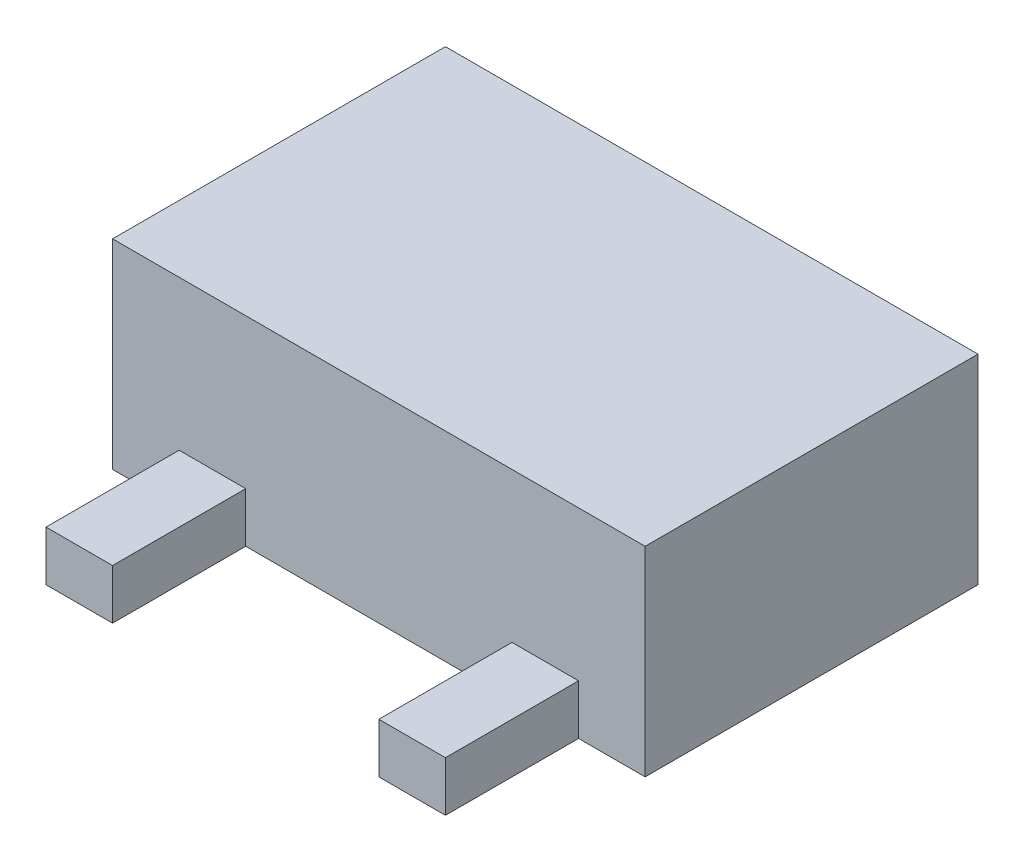
ISO-10303-21;
HEADER;
FILE_DESCRIPTION(('STEP AP214'),'2;1');
FILE_NAME('part.step','',(''),(''),'','','');
FILE_SCHEMA(('AUTOMOTIVE_DESIGN { 1 0 10303 214 1 1 1 1 }'));
ENDSEC;
DATA;
#1=APPLICATION_CONTEXT('core data for automotive mechanical design processes');
#2=APPLICATION_PROTOCOL_DEFINITION('international standard','automotive_design',2000,#1);
#3=PRODUCT_CONTEXT('',#1,'mechanical');
#4=PRODUCT('Part','Part','',(#3));
#5=PRODUCT_RELATED_PRODUCT_CATEGORY('part','',(#4));
#6=PRODUCT_DEFINITION_FORMATION('','',#4);
#7=PRODUCT_DEFINITION_CONTEXT('part definition',#1,'design');
#8=PRODUCT_DEFINITION('design','',#6,#7);
#9=PRODUCT_DEFINITION_SHAPE('','',#8);
#10=(LENGTH_UNIT() NAMED_UNIT(*) SI_UNIT(.MILLI.,.METRE.));
#11=(NAMED_UNIT(*) PLANE_ANGLE_UNIT() SI_UNIT($,.RADIAN.));
#12=(NAMED_UNIT(*) SI_UNIT($,.STERADIAN.) SOLID_ANGLE_UNIT());
#13=UNCERTAINTY_MEASURE_WITH_UNIT(LENGTH_MEASURE(1.E-05),#10,'distance_accuracy_value','');
#14=(GEOMETRIC_REPRESENTATION_CONTEXT(3) GLOBAL_UNCERTAINTY_ASSIGNED_CONTEXT((#13)) GLOBAL_UNIT_ASSIGNED_CONTEXT((#10,
#11,#12)) REPRESENTATION_CONTEXT('',''));
#15=CARTESIAN_POINT('',(0.,0.,0.));
#16=DIRECTION('',(0.,0.,1.));
#17=DIRECTION('',(1.,0.,0.));
#18=AXIS2_PLACEMENT_3D('',#15,#16,#17);
#19=CARTESIAN_POINT('',(-0.8,0.6,0.5));
#20=DIRECTION('',(0.,0.,-1.));
#21=DIRECTION('',(-1.,0.,0.));
#22=AXIS2_PLACEMENT_3D('',#19,#20,#21);
#23=PLANE('',#22);
#24=DIRECTION('',(-1.,0.,0.));
#25=VECTOR('',#24,1.);
#26=CARTESIAN_POINT('',(0.6,0.15,0.5));
#27=LINE('',#26,#25);
#28=CARTESIAN_POINT('',(0.6,0.15,0.5));
#29=VERTEX_POINT('',#28);
#30=CARTESIAN_POINT('',(0.4,0.15,0.5));
#31=VERTEX_POINT('',#30);
#32=EDGE_CURVE('E53',#29,#31,#27,.T.);
#33=ORIENTED_EDGE('',*,*,#32,.F.);
#34=DIRECTION('',(0.,-1.,0.));
#35=VECTOR('',#34,1.);
#36=CARTESIAN_POINT('',(0.6,0.597213595499958,0.5));
#37=LINE('',#36,#35);
#38=CARTESIAN_POINT('',(0.6,0.,0.5));
#39=VERTEX_POINT('',#38);
#40=EDGE_CURVE('E161',#29,#39,#37,.T.);
#41=ORIENTED_EDGE('',*,*,#40,.T.);
#42=DIRECTION('',(1.,0.,0.));
#43=VECTOR('',#42,1.);
#44=CARTESIAN_POINT('',(-0.8,0.,0.5));
#45=LINE('',#44,#43);
#46=CARTESIAN_POINT('',(0.8,0.,0.5));
#47=VERTEX_POINT('',#46);
#48=EDGE_CURVE('E146',#39,#47,#45,.T.);
#49=ORIENTED_EDGE('',*,*,#48,.T.);
#50=DIRECTION('',(0.,-1.,0.));
#51=VECTOR('',#50,1.);
#52=CARTESIAN_POINT('',(0.8,0.6,0.5));
#53=LINE('',#52,#51);
#54=CARTESIAN_POINT('',(0.8,0.6,0.5));
#55=VERTEX_POINT('',#54);
#56=EDGE_CURVE('E248',#55,#47,#53,.T.);
#57=ORIENTED_EDGE('',*,*,#56,.F.);
#58=DIRECTION('',(1.,0.,0.));
#59=VECTOR('',#58,1.);
#60=CARTESIAN_POINT('',(-0.8,0.6,0.5));
#61=LINE('',#60,#59);
#62=CARTESIAN_POINT('',(-0.8,0.6,0.5));
#63=VERTEX_POINT('',#62);
#64=EDGE_CURVE('E246',#63,#55,#61,.T.);
#65=ORIENTED_EDGE('',*,*,#64,.F.);
#66=DIRECTION('',(0.,-1.,0.));
#67=VECTOR('',#66,1.);
#68=CARTESIAN_POINT('',(-0.8,0.6,0.5));
#69=LINE('',#68,#67);
#70=CARTESIAN_POINT('',(-0.8,0.,0.5));
#71=VERTEX_POINT('',#70);
#72=EDGE_CURVE('E257',#63,#71,#69,.T.);
#73=ORIENTED_EDGE('',*,*,#72,.T.);
#74=CARTESIAN_POINT('',(-0.6,0.,0.5));
#75=VERTEX_POINT('',#74);
#76=EDGE_CURVE('E159',#71,#75,#45,.T.);
#77=ORIENTED_EDGE('',*,*,#76,.T.);
#78=DIRECTION('',(0.,-1.,0.));
#79=VECTOR('',#78,1.);
#80=CARTESIAN_POINT('',(-0.6,0.597213595499958,0.5));
#81=LINE('',#80,#79);
#82=CARTESIAN_POINT('',(-0.6,0.15,0.5));
#83=VERTEX_POINT('',#82);
#84=EDGE_CURVE('E204',#83,#75,#81,.T.);
#85=ORIENTED_EDGE('',*,*,#84,.F.);
#86=DIRECTION('',(1.,0.,0.));
#87=VECTOR('',#86,1.);
#88=CARTESIAN_POINT('',(-0.6,0.15,0.5));
#89=LINE('',#88,#87);
#90=CARTESIAN_POINT('',(-0.4,0.15,0.5));
#91=VERTEX_POINT('',#90);
#92=EDGE_CURVE('E190',#83,#91,#89,.T.);
#93=ORIENTED_EDGE('',*,*,#92,.T.);
#94=DIRECTION('',(0.,-1.,0.));
#95=VECTOR('',#94,1.);
#96=CARTESIAN_POINT('',(-0.4,0.597213595499958,0.5));
#97=LINE('',#96,#95);
#98=CARTESIAN_POINT('',(-0.4,0.,0.5));
#99=VERTEX_POINT('',#98);
#100=EDGE_CURVE('E206',#91,#99,#97,.T.);
#101=ORIENTED_EDGE('',*,*,#100,.T.);
#102=CARTESIAN_POINT('',(0.4,0.,0.5));
#103=VERTEX_POINT('',#102);
#104=EDGE_CURVE('E156',#99,#103,#45,.T.);
#105=ORIENTED_EDGE('',*,*,#104,.T.);
#106=DIRECTION('',(0.,-1.,0.));
#107=VECTOR('',#106,1.);
#108=CARTESIAN_POINT('',(0.4,0.597213595499958,0.5));
#109=LINE('',#108,#107);
#110=EDGE_CURVE('E49',#31,#103,#109,.T.);
#111=ORIENTED_EDGE('',*,*,#110,.F.);
#112=EDGE_LOOP('',(#33,#41,#49,#57,#65,#73,#77,#85,#93,#101,#105,#111));
#113=FACE_BOUND('',#112,.T.);
#114=ADVANCED_FACE('F34',(#113),#23,.F.);
#115=CARTESIAN_POINT('',(-0.8,0.6,-0.5));
#116=DIRECTION('',(0.,0.,1.));
#117=DIRECTION('',(1.,0.,0.));
#118=AXIS2_PLACEMENT_3D('',#115,#116,#117);
#119=PLANE('',#118);
#120=DIRECTION('',(0.,-1.,0.));
#121=VECTOR('',#120,1.);
#122=CARTESIAN_POINT('',(0.1,0.15,-0.500000000000001));
#123=LINE('',#122,#121);
#124=CARTESIAN_POINT('',(0.1,0.15,-0.500000000000001));
#125=VERTEX_POINT('',#124);
#126=CARTESIAN_POINT('',(0.1,0.,-0.500000000000001));
#127=VERTEX_POINT('',#126);
#128=EDGE_CURVE('E234',#125,#127,#123,.T.);
#129=ORIENTED_EDGE('',*,*,#128,.F.);
#130=DIRECTION('',(1.,0.,0.));
#131=VECTOR('',#130,1.);
#132=CARTESIAN_POINT('',(-0.1,0.15,-0.500000000000001));
#133=LINE('',#132,#131);
#134=CARTESIAN_POINT('',(-0.1,0.15,-0.500000000000001));
#135=VERTEX_POINT('',#134);
#136=EDGE_CURVE('E217',#135,#125,#133,.T.);
#137=ORIENTED_EDGE('',*,*,#136,.F.);
#138=DIRECTION('',(0.,-1.,0.));
#139=VECTOR('',#138,1.);
#140=CARTESIAN_POINT('',(-0.1,0.15,-0.500000000000001));
#141=LINE('',#140,#139);
#142=CARTESIAN_POINT('',(-0.1,0.,-0.5));
#143=VERTEX_POINT('',#142);
#144=EDGE_CURVE('E236',#135,#143,#141,.T.);
#145=ORIENTED_EDGE('',*,*,#144,.T.);
#146=DIRECTION('',(-1.,0.,0.));
#147=VECTOR('',#146,1.);
#148=CARTESIAN_POINT('',(-0.8,0.,-0.5));
#149=LINE('',#148,#147);
#150=CARTESIAN_POINT('',(-0.8,0.,-0.5));
#151=VERTEX_POINT('',#150);
#152=EDGE_CURVE('E250',#143,#151,#149,.T.);
#153=ORIENTED_EDGE('',*,*,#152,.T.);
#154=DIRECTION('',(0.,-1.,0.));
#155=VECTOR('',#154,1.);
#156=CARTESIAN_POINT('',(-0.8,0.6,-0.5));
#157=LINE('',#156,#155);
#158=CARTESIAN_POINT('',(-0.8,0.6,-0.5));
#159=VERTEX_POINT('',#158);
#160=EDGE_CURVE('E42',#159,#151,#157,.T.);
#161=ORIENTED_EDGE('',*,*,#160,.F.);
#162=DIRECTION('',(-1.,0.,0.));
#163=VECTOR('',#162,1.);
#164=CARTESIAN_POINT('',(-0.8,0.6,-0.5));
#165=LINE('',#164,#163);
#166=CARTESIAN_POINT('',(0.8,0.6,-0.5));
#167=VERTEX_POINT('',#166);
#168=EDGE_CURVE('E242',#167,#159,#165,.T.);
#169=ORIENTED_EDGE('',*,*,#168,.F.);
#170=DIRECTION('',(0.,-1.,0.));
#171=VECTOR('',#170,1.);
#172=CARTESIAN_POINT('',(0.8,0.6,-0.5));
#173=LINE('',#172,#171);
#174=CARTESIAN_POINT('',(0.8,0.,-0.5));
#175=VERTEX_POINT('',#174);
#176=EDGE_CURVE('E11',#167,#175,#173,.T.);
#177=ORIENTED_EDGE('',*,*,#176,.T.);
#178=EDGE_CURVE('E251',#175,#127,#149,.T.);
#179=ORIENTED_EDGE('',*,*,#178,.T.);
#180=EDGE_LOOP('',(#129,#137,#145,#153,#161,#169,#177,#179));
#181=FACE_BOUND('',#180,.T.);
#182=ADVANCED_FACE('F279',(#181),#119,.F.);
#183=CARTESIAN_POINT('',(0.8,0.6,-0.5));
#184=DIRECTION('',(-1.,0.,0.));
#185=DIRECTION('',(0.,0.,1.));
#186=AXIS2_PLACEMENT_3D('',#183,#184,#185);
#187=PLANE('',#186);
#188=DIRECTION('',(0.,0.,-1.));
#189=VECTOR('',#188,1.);
#190=CARTESIAN_POINT('',(0.8,0.,-0.5));
#191=LINE('',#190,#189);
#192=EDGE_CURVE('E153',#47,#175,#191,.T.);
#193=ORIENTED_EDGE('',*,*,#192,.T.);
#194=ORIENTED_EDGE('',*,*,#176,.F.);
#195=DIRECTION('',(0.,0.,-1.));
#196=VECTOR('',#195,1.);
#197=CARTESIAN_POINT('',(0.8,0.6,-0.5));
#198=LINE('',#197,#196);
#199=EDGE_CURVE('E239',#55,#167,#198,.T.);
#200=ORIENTED_EDGE('',*,*,#199,.F.);
#201=ORIENTED_EDGE('',*,*,#56,.T.);
#202=EDGE_LOOP('',(#193,#194,#200,#201));
#203=FACE_BOUND('',#202,.T.);
#204=ADVANCED_FACE('F36',(#203),#187,.F.);
#205=CARTESIAN_POINT('',(-0.8,0.6,-0.5));
#206=DIRECTION('',(1.,0.,0.));
#207=DIRECTION('',(0.,0.,-1.));
#208=AXIS2_PLACEMENT_3D('',#205,#206,#207);
#209=PLANE('',#208);
#210=DIRECTION('',(0.,0.,1.));
#211=VECTOR('',#210,1.);
#212=CARTESIAN_POINT('',(-0.8,0.,-0.5));
#213=LINE('',#212,#211);
#214=EDGE_CURVE('E157',#151,#71,#213,.T.);
#215=ORIENTED_EDGE('',*,*,#214,.T.);
#216=ORIENTED_EDGE('',*,*,#72,.F.);
#217=DIRECTION('',(0.,0.,1.));
#218=VECTOR('',#217,1.);
#219=CARTESIAN_POINT('',(-0.8,0.6,-0.5));
#220=LINE('',#219,#218);
#221=EDGE_CURVE('E244',#159,#63,#220,.T.);
#222=ORIENTED_EDGE('',*,*,#221,.F.);
#223=ORIENTED_EDGE('',*,*,#160,.T.);
#224=EDGE_LOOP('',(#215,#216,#222,#223));
#225=FACE_BOUND('',#224,.T.);
#226=ADVANCED_FACE('F264',(#225),#209,.F.);
#227=CARTESIAN_POINT('',(0.,0.6,0.));
#228=DIRECTION('',(0.,1.,0.));
#229=DIRECTION('',(0.,0.,1.));
#230=AXIS2_PLACEMENT_3D('',#227,#228,#229);
#231=PLANE('',#230);
#232=ORIENTED_EDGE('',*,*,#199,.T.);
#233=ORIENTED_EDGE('',*,*,#168,.T.);
#234=ORIENTED_EDGE('',*,*,#221,.T.);
#235=ORIENTED_EDGE('',*,*,#64,.T.);
#236=EDGE_LOOP('',(#232,#233,#234,#235));
#237=FACE_BOUND('',#236,.T.);
#238=ADVANCED_FACE('F276',(#237),#231,.T.);
#239=CARTESIAN_POINT('',(0.,0.,0.));
#240=DIRECTION('',(0.,1.,0.));
#241=DIRECTION('',(0.,0.,1.));
#242=AXIS2_PLACEMENT_3D('',#239,#240,#241);
#243=PLANE('',#242);
#244=ORIENTED_EDGE('',*,*,#192,.F.);
#245=ORIENTED_EDGE('',*,*,#48,.F.);
#246=DIRECTION('',(0.,0.,1.));
#247=VECTOR('',#246,1.);
#248=CARTESIAN_POINT('',(0.6,0.,0.5));
#249=LINE('',#248,#247);
#250=CARTESIAN_POINT('',(0.6,0.,0.9));
#251=VERTEX_POINT('',#250);
#252=EDGE_CURVE('E150',#39,#251,#249,.T.);
#253=ORIENTED_EDGE('',*,*,#252,.T.);
#254=DIRECTION('',(-1.,0.,0.));
#255=VECTOR('',#254,1.);
#256=CARTESIAN_POINT('',(0.6,0.,0.9));
#257=LINE('',#256,#255);
#258=CARTESIAN_POINT('',(0.4,0.,0.9));
#259=VERTEX_POINT('',#258);
#260=EDGE_CURVE('E172',#251,#259,#257,.T.);
#261=ORIENTED_EDGE('',*,*,#260,.T.);
#262=DIRECTION('',(0.,0.,-1.));
#263=VECTOR('',#262,1.);
#264=CARTESIAN_POINT('',(0.4,0.,0.5));
#265=LINE('',#264,#263);
#266=EDGE_CURVE('E169',#259,#103,#265,.T.);
#267=ORIENTED_EDGE('',*,*,#266,.T.);
#268=ORIENTED_EDGE('',*,*,#104,.F.);
#269=DIRECTION('',(0.,0.,-1.));
#270=VECTOR('',#269,1.);
#271=CARTESIAN_POINT('',(-0.4,0.,0.5));
#272=LINE('',#271,#270);
#273=CARTESIAN_POINT('',(-0.4,0.,0.9));
#274=VERTEX_POINT('',#273);
#275=EDGE_CURVE('E202',#274,#99,#272,.T.);
#276=ORIENTED_EDGE('',*,*,#275,.F.);
#277=DIRECTION('',(1.,0.,0.));
#278=VECTOR('',#277,1.);
#279=CARTESIAN_POINT('',(-0.6,0.,0.9));
#280=LINE('',#279,#278);
#281=CARTESIAN_POINT('',(-0.6,0.,0.9));
#282=VERTEX_POINT('',#281);
#283=EDGE_CURVE('E199',#282,#274,#280,.T.);
#284=ORIENTED_EDGE('',*,*,#283,.F.);
#285=DIRECTION('',(0.,0.,1.));
#286=VECTOR('',#285,1.);
#287=CARTESIAN_POINT('',(-0.6,0.,0.5));
#288=LINE('',#287,#286);
#289=EDGE_CURVE('E185',#75,#282,#288,.T.);
#290=ORIENTED_EDGE('',*,*,#289,.F.);
#291=ORIENTED_EDGE('',*,*,#76,.F.);
#292=ORIENTED_EDGE('',*,*,#214,.F.);
#293=ORIENTED_EDGE('',*,*,#152,.F.);
#294=DIRECTION('',(0.,0.,1.));
#295=VECTOR('',#294,1.);
#296=CARTESIAN_POINT('',(-0.1,0.,-0.500000000000001));
#297=LINE('',#296,#295);
#298=CARTESIAN_POINT('',(-0.1,0.,-0.900000000000001));
#299=VERTEX_POINT('',#298);
#300=EDGE_CURVE('E196',#299,#143,#297,.T.);
#301=ORIENTED_EDGE('',*,*,#300,.F.);
#302=DIRECTION('',(-1.,0.,0.));
#303=VECTOR('',#302,1.);
#304=CARTESIAN_POINT('',(-0.1,0.,-0.900000000000001));
#305=LINE('',#304,#303);
#306=CARTESIAN_POINT('',(0.1,0.,-0.9));
#307=VERTEX_POINT('',#306);
#308=EDGE_CURVE('E218',#307,#299,#305,.T.);
#309=ORIENTED_EDGE('',*,*,#308,.F.);
#310=DIRECTION('',(0.,0.,-1.));
#311=VECTOR('',#310,1.);
#312=CARTESIAN_POINT('',(0.1,0.,-0.500000000000001));
#313=LINE('',#312,#311);
#314=EDGE_CURVE('E226',#127,#307,#313,.T.);
#315=ORIENTED_EDGE('',*,*,#314,.F.);
#316=ORIENTED_EDGE('',*,*,#178,.F.);
#317=EDGE_LOOP('',(#244,#245,#253,#261,#267,#268,#276,#284,#290,#291,#292,#293,#301,#309,#315,#316));
#318=FACE_BOUND('',#317,.T.);
#319=ADVANCED_FACE('F147',(#318),#243,.F.);
#320=CARTESIAN_POINT('',(-0.1,0.15,-0.500000000000001));
#321=DIRECTION('',(1.,0.,0.));
#322=DIRECTION('',(0.,0.,-1.));
#323=AXIS2_PLACEMENT_3D('',#320,#321,#322);
#324=PLANE('',#323);
#325=ORIENTED_EDGE('',*,*,#300,.T.);
#326=ORIENTED_EDGE('',*,*,#144,.F.);
#327=DIRECTION('',(0.,0.,1.));
#328=VECTOR('',#327,1.);
#329=CARTESIAN_POINT('',(-0.1,0.15,-0.500000000000001));
#330=LINE('',#329,#328);
#331=CARTESIAN_POINT('',(-0.1,0.15,-0.900000000000001));
#332=VERTEX_POINT('',#331);
#333=EDGE_CURVE('E215',#332,#135,#330,.T.);
#334=ORIENTED_EDGE('',*,*,#333,.F.);
#335=DIRECTION('',(0.,-1.,0.));
#336=VECTOR('',#335,1.);
#337=CARTESIAN_POINT('',(-0.1,0.15,-0.900000000000001));
#338=LINE('',#337,#336);
#339=EDGE_CURVE('E224',#332,#299,#338,.T.);
#340=ORIENTED_EDGE('',*,*,#339,.T.);
#341=EDGE_LOOP('',(#325,#326,#334,#340));
#342=FACE_BOUND('',#341,.T.);
#343=ADVANCED_FACE('F294',(#342),#324,.F.);
#344=CARTESIAN_POINT('',(0.1,0.15,-0.500000000000001));
#345=DIRECTION('',(-1.,0.,0.));
#346=DIRECTION('',(0.,0.,1.));
#347=AXIS2_PLACEMENT_3D('',#344,#345,#346);
#348=PLANE('',#347);
#349=ORIENTED_EDGE('',*,*,#314,.T.);
#350=DIRECTION('',(0.,-1.,0.));
#351=VECTOR('',#350,1.);
#352=CARTESIAN_POINT('',(0.1,0.15,-0.9));
#353=LINE('',#352,#351);
#354=CARTESIAN_POINT('',(0.1,0.15,-0.9));
#355=VERTEX_POINT('',#354);
#356=EDGE_CURVE('E231',#355,#307,#353,.T.);
#357=ORIENTED_EDGE('',*,*,#356,.F.);
#358=DIRECTION('',(0.,0.,-1.));
#359=VECTOR('',#358,1.);
#360=CARTESIAN_POINT('',(0.1,0.15,-0.500000000000001));
#361=LINE('',#360,#359);
#362=EDGE_CURVE('E220',#125,#355,#361,.T.);
#363=ORIENTED_EDGE('',*,*,#362,.F.);
#364=ORIENTED_EDGE('',*,*,#128,.T.);
#365=EDGE_LOOP('',(#349,#357,#363,#364));
#366=FACE_BOUND('',#365,.T.);
#367=ADVANCED_FACE('F299',(#366),#348,.F.);
#368=CARTESIAN_POINT('',(-0.1,0.15,-0.900000000000001));
#369=DIRECTION('',(0.,0.,1.));
#370=DIRECTION('',(1.,0.,0.));
#371=AXIS2_PLACEMENT_3D('',#368,#369,#370);
#372=PLANE('',#371);
#373=ORIENTED_EDGE('',*,*,#308,.T.);
#374=ORIENTED_EDGE('',*,*,#339,.F.);
#375=DIRECTION('',(-1.,0.,0.));
#376=VECTOR('',#375,1.);
#377=CARTESIAN_POINT('',(-0.1,0.15,-0.900000000000001));
#378=LINE('',#377,#376);
#379=EDGE_CURVE('E222',#355,#332,#378,.T.);
#380=ORIENTED_EDGE('',*,*,#379,.F.);
#381=ORIENTED_EDGE('',*,*,#356,.T.);
#382=EDGE_LOOP('',(#373,#374,#380,#381));
#383=FACE_BOUND('',#382,.T.);
#384=ADVANCED_FACE('F303',(#383),#372,.F.);
#385=CARTESIAN_POINT('',(0.,0.15,0.));
#386=DIRECTION('',(0.,-1.,0.));
#387=DIRECTION('',(0.,0.,-1.));
#388=AXIS2_PLACEMENT_3D('',#385,#386,#387);
#389=PLANE('',#388);
#390=ORIENTED_EDGE('',*,*,#333,.T.);
#391=ORIENTED_EDGE('',*,*,#136,.T.);
#392=ORIENTED_EDGE('',*,*,#362,.T.);
#393=ORIENTED_EDGE('',*,*,#379,.T.);
#394=EDGE_LOOP('',(#390,#391,#392,#393));
#395=FACE_BOUND('',#394,.T.);
#396=ADVANCED_FACE('F307',(#395),#389,.F.);
#397=CARTESIAN_POINT('',(-0.4,0.597213595499958,0.5));
#398=DIRECTION('',(-1.,0.,0.));
#399=DIRECTION('',(0.,0.,1.));
#400=AXIS2_PLACEMENT_3D('',#397,#398,#399);
#401=PLANE('',#400);
#402=ORIENTED_EDGE('',*,*,#100,.F.);
#403=DIRECTION('',(0.,0.,1.));
#404=VECTOR('',#403,1.);
#405=CARTESIAN_POINT('',(-0.4,0.15,0.5));
#406=LINE('',#405,#404);
#407=CARTESIAN_POINT('',(-0.4,0.15,0.9));
#408=VERTEX_POINT('',#407);
#409=EDGE_CURVE('E186',#91,#408,#406,.T.);
#410=ORIENTED_EDGE('',*,*,#409,.T.);
#411=DIRECTION('',(0.,-1.,0.));
#412=VECTOR('',#411,1.);
#413=CARTESIAN_POINT('',(-0.4,0.597213595499958,0.9));
#414=LINE('',#413,#412);
#415=EDGE_CURVE('E209',#408,#274,#414,.T.);
#416=ORIENTED_EDGE('',*,*,#415,.T.);
#417=ORIENTED_EDGE('',*,*,#275,.T.);
#418=EDGE_LOOP('',(#402,#410,#416,#417));
#419=FACE_BOUND('',#418,.T.);
#420=ADVANCED_FACE('F311',(#419),#401,.F.);
#421=CARTESIAN_POINT('',(-0.6,0.597213595499958,0.9));
#422=DIRECTION('',(0.,0.,-1.));
#423=DIRECTION('',(-1.,0.,0.));
#424=AXIS2_PLACEMENT_3D('',#421,#422,#423);
#425=PLANE('',#424);
#426=ORIENTED_EDGE('',*,*,#415,.F.);
#427=DIRECTION('',(-1.,0.,0.));
#428=VECTOR('',#427,1.);
#429=CARTESIAN_POINT('',(-0.6,0.15,0.9));
#430=LINE('',#429,#428);
#431=CARTESIAN_POINT('',(-0.6,0.15,0.9));
#432=VERTEX_POINT('',#431);
#433=EDGE_CURVE('E189',#408,#432,#430,.T.);
#434=ORIENTED_EDGE('',*,*,#433,.T.);
#435=DIRECTION('',(0.,-1.,0.));
#436=VECTOR('',#435,1.);
#437=CARTESIAN_POINT('',(-0.6,0.597213595499958,0.9));
#438=LINE('',#437,#436);
#439=EDGE_CURVE('E211',#432,#282,#438,.T.);
#440=ORIENTED_EDGE('',*,*,#439,.T.);
#441=ORIENTED_EDGE('',*,*,#283,.T.);
#442=EDGE_LOOP('',(#426,#434,#440,#441));
#443=FACE_BOUND('',#442,.T.);
#444=ADVANCED_FACE('F317',(#443),#425,.F.);
#445=CARTESIAN_POINT('',(-0.6,0.597213595499958,0.5));
#446=DIRECTION('',(1.,0.,0.));
#447=DIRECTION('',(0.,0.,-1.));
#448=AXIS2_PLACEMENT_3D('',#445,#446,#447);
#449=PLANE('',#448);
#450=ORIENTED_EDGE('',*,*,#439,.F.);
#451=DIRECTION('',(0.,0.,-1.));
#452=VECTOR('',#451,1.);
#453=CARTESIAN_POINT('',(-0.6,0.15,0.5));
#454=LINE('',#453,#452);
#455=EDGE_CURVE('E193',#432,#83,#454,.T.);
#456=ORIENTED_EDGE('',*,*,#455,.T.);
#457=ORIENTED_EDGE('',*,*,#84,.T.);
#458=ORIENTED_EDGE('',*,*,#289,.T.);
#459=EDGE_LOOP('',(#450,#456,#457,#458));
#460=FACE_BOUND('',#459,.T.);
#461=ADVANCED_FACE('F313',(#460),#449,.F.);
#462=CARTESIAN_POINT('',(0.,0.15,0.));
#463=DIRECTION('',(0.,-1.,0.));
#464=DIRECTION('',(0.,0.,-1.));
#465=AXIS2_PLACEMENT_3D('',#462,#463,#464);
#466=PLANE('',#465);
#467=ORIENTED_EDGE('',*,*,#433,.F.);
#468=ORIENTED_EDGE('',*,*,#409,.F.);
#469=ORIENTED_EDGE('',*,*,#92,.F.);
#470=ORIENTED_EDGE('',*,*,#455,.F.);
#471=EDGE_LOOP('',(#467,#468,#469,#470));
#472=FACE_BOUND('',#471,.T.);
#473=ADVANCED_FACE('F316',(#472),#466,.F.);
#474=CARTESIAN_POINT('',(0.6,0.597213595499958,0.5));
#475=DIRECTION('',(1.,0.,0.));
#476=DIRECTION('',(0.,0.,-1.));
#477=AXIS2_PLACEMENT_3D('',#474,#475,#476);
#478=PLANE('',#477);
#479=DIRECTION('',(0.,0.,-1.));
#480=VECTOR('',#479,1.);
#481=CARTESIAN_POINT('',(0.6,0.15,0.5));
#482=LINE('',#481,#480);
#483=CARTESIAN_POINT('',(0.6,0.15,0.9));
#484=VERTEX_POINT('',#483);
#485=EDGE_CURVE('E175',#484,#29,#482,.T.);
#486=ORIENTED_EDGE('',*,*,#485,.F.);
#487=DIRECTION('',(0.,-1.,0.));
#488=VECTOR('',#487,1.);
#489=CARTESIAN_POINT('',(0.6,0.597213595499958,0.9));
#490=LINE('',#489,#488);
#491=EDGE_CURVE('E168',#484,#251,#490,.T.);
#492=ORIENTED_EDGE('',*,*,#491,.T.);
#493=ORIENTED_EDGE('',*,*,#252,.F.);
#494=ORIENTED_EDGE('',*,*,#40,.F.);
#495=EDGE_LOOP('',(#486,#492,#493,#494));
#496=FACE_BOUND('',#495,.T.);
#497=ADVANCED_FACE('F166',(#496),#478,.T.);
#498=CARTESIAN_POINT('',(0.4,0.597213595499958,0.5));
#499=DIRECTION('',(-1.,0.,0.));
#500=DIRECTION('',(0.,0.,1.));
#501=AXIS2_PLACEMENT_3D('',#498,#499,#500);
#502=PLANE('',#501);
#503=DIRECTION('',(0.,0.,1.));
#504=VECTOR('',#503,1.);
#505=CARTESIAN_POINT('',(0.4,0.15,0.5));
#506=LINE('',#505,#504);
#507=CARTESIAN_POINT('',(0.4,0.15,0.9));
#508=VERTEX_POINT('',#507);
#509=EDGE_CURVE('E164',#31,#508,#506,.T.);
#510=ORIENTED_EDGE('',*,*,#509,.F.);
#511=ORIENTED_EDGE('',*,*,#110,.T.);
#512=ORIENTED_EDGE('',*,*,#266,.F.);
#513=DIRECTION('',(0.,-1.,0.));
#514=VECTOR('',#513,1.);
#515=CARTESIAN_POINT('',(0.4,0.597213595499958,0.9));
#516=LINE('',#515,#514);
#517=EDGE_CURVE('E180',#508,#259,#516,.T.);
#518=ORIENTED_EDGE('',*,*,#517,.F.);
#519=EDGE_LOOP('',(#510,#511,#512,#518));
#520=FACE_BOUND('',#519,.T.);
#521=ADVANCED_FACE('F330',(#520),#502,.T.);
#522=CARTESIAN_POINT('',(0.6,0.597213595499958,0.9));
#523=DIRECTION('',(0.,0.,1.));
#524=DIRECTION('',(1.,0.,0.));
#525=AXIS2_PLACEMENT_3D('',#522,#523,#524);
#526=PLANE('',#525);
#527=DIRECTION('',(1.,0.,0.));
#528=VECTOR('',#527,1.);
#529=CARTESIAN_POINT('',(0.6,0.15,0.9));
#530=LINE('',#529,#528);
#531=EDGE_CURVE('E183',#508,#484,#530,.T.);
#532=ORIENTED_EDGE('',*,*,#531,.F.);
#533=ORIENTED_EDGE('',*,*,#517,.T.);
#534=ORIENTED_EDGE('',*,*,#260,.F.);
#535=ORIENTED_EDGE('',*,*,#491,.F.);
#536=EDGE_LOOP('',(#532,#533,#534,#535));
#537=FACE_BOUND('',#536,.T.);
#538=ADVANCED_FACE('F333',(#537),#526,.T.);
#539=CARTESIAN_POINT('',(0.,0.15,0.));
#540=DIRECTION('',(0.,-1.,0.));
#541=DIRECTION('',(0.,0.,-1.));
#542=AXIS2_PLACEMENT_3D('',#539,#540,#541);
#543=PLANE('',#542);
#544=ORIENTED_EDGE('',*,*,#485,.T.);
#545=ORIENTED_EDGE('',*,*,#32,.T.);
#546=ORIENTED_EDGE('',*,*,#509,.T.);
#547=ORIENTED_EDGE('',*,*,#531,.T.);
#548=EDGE_LOOP('',(#544,#545,#546,#547));
#549=FACE_BOUND('',#548,.T.);
#550=ADVANCED_FACE('F337',(#549),#543,.F.);
#551=CLOSED_SHELL('',(#114,#182,#204,#226,#238,#319,#343,#367,#384,#396,#420,#444,#461,#473,
#497,#521,#538,#550));
#552=MANIFOLD_SOLID_BREP('B2',#551);
#553=ADVANCED_BREP_SHAPE_REPRESENTATION('',(#18,#552),#14);
#554=SHAPE_DEFINITION_REPRESENTATION(#9,#553);
ENDSEC;
END-ISO-10303-21;
